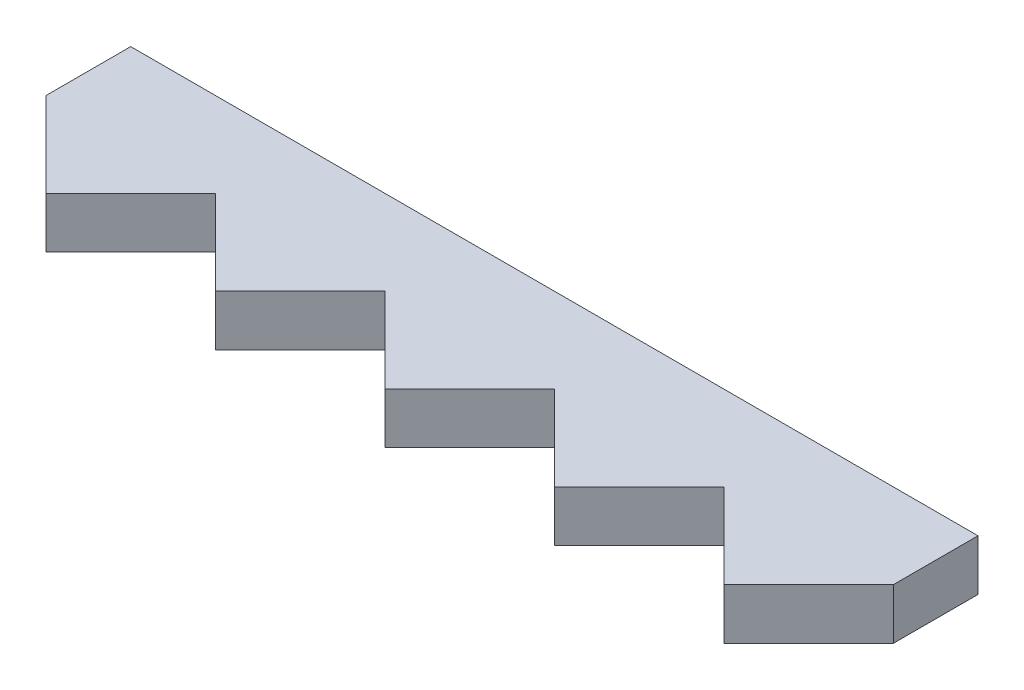
ISO-10303-21;
HEADER;
FILE_DESCRIPTION(('STEP AP214'),'2;1');
FILE_NAME('part.step','',(''),(''),'','','');
FILE_SCHEMA(('AUTOMOTIVE_DESIGN { 1 0 10303 214 1 1 1 1 }'));
ENDSEC;
DATA;
#1=APPLICATION_CONTEXT('core data for automotive mechanical design processes');
#2=APPLICATION_PROTOCOL_DEFINITION('international standard','automotive_design',2000,#1);
#3=PRODUCT_CONTEXT('',#1,'mechanical');
#4=PRODUCT('Part','Part','',(#3));
#5=PRODUCT_RELATED_PRODUCT_CATEGORY('part','',(#4));
#6=PRODUCT_DEFINITION_FORMATION('','',#4);
#7=PRODUCT_DEFINITION_CONTEXT('part definition',#1,'design');
#8=PRODUCT_DEFINITION('design','',#6,#7);
#9=PRODUCT_DEFINITION_SHAPE('','',#8);
#10=(LENGTH_UNIT() NAMED_UNIT(*) SI_UNIT(.MILLI.,.METRE.));
#11=(NAMED_UNIT(*) PLANE_ANGLE_UNIT() SI_UNIT($,.RADIAN.));
#12=(NAMED_UNIT(*) SI_UNIT($,.STERADIAN.) SOLID_ANGLE_UNIT());
#13=UNCERTAINTY_MEASURE_WITH_UNIT(LENGTH_MEASURE(1.E-05),#10,'distance_accuracy_value','');
#14=(GEOMETRIC_REPRESENTATION_CONTEXT(3) GLOBAL_UNCERTAINTY_ASSIGNED_CONTEXT((#13)) GLOBAL_UNIT_ASSIGNED_CONTEXT((#10,
#11,#12)) REPRESENTATION_CONTEXT('',''));
#15=CARTESIAN_POINT('',(0.,0.,0.));
#16=DIRECTION('',(0.,0.,1.));
#17=DIRECTION('',(1.,0.,0.));
#18=AXIS2_PLACEMENT_3D('',#15,#16,#17);
#19=CARTESIAN_POINT('',(0.,6.,-71.6064280380383));
#20=DIRECTION('',(0.,0.,1.));
#21=DIRECTION('',(1.,0.,0.));
#22=AXIS2_PLACEMENT_3D('',#19,#20,#21);
#23=PLANE('',#22);
#24=DIRECTION('',(-1.,0.,0.));
#25=VECTOR('',#24,1.);
#26=CARTESIAN_POINT('',(0.,3.,-71.6064280380383));
#27=LINE('',#26,#25);
#28=CARTESIAN_POINT('',(50.,3.,-71.6064280380383));
#29=VERTEX_POINT('',#28);
#30=CARTESIAN_POINT('',(0.,3.,-71.6064280380383));
#31=VERTEX_POINT('',#30);
#32=EDGE_CURVE('E159',#29,#31,#27,.T.);
#33=ORIENTED_EDGE('',*,*,#32,.T.);
#34=DIRECTION('',(0.,-1.,0.));
#35=VECTOR('',#34,1.);
#36=CARTESIAN_POINT('',(0.,6.,-71.6064280380383));
#37=LINE('',#36,#35);
#38=CARTESIAN_POINT('',(0.,6.,-71.6064280380383));
#39=VERTEX_POINT('',#38);
#40=EDGE_CURVE('E11',#39,#31,#37,.T.);
#41=ORIENTED_EDGE('',*,*,#40,.F.);
#42=DIRECTION('',(-1.,0.,0.));
#43=VECTOR('',#42,1.);
#44=CARTESIAN_POINT('',(0.,6.,-71.6064280380383));
#45=LINE('',#44,#43);
#46=CARTESIAN_POINT('',(50.,6.,-71.6064280380383));
#47=VERTEX_POINT('',#46);
#48=EDGE_CURVE('E183',#47,#39,#45,.T.);
#49=ORIENTED_EDGE('',*,*,#48,.F.);
#50=DIRECTION('',(0.,-1.,0.));
#51=VECTOR('',#50,1.);
#52=CARTESIAN_POINT('',(50.,6.,-71.6064280380383));
#53=LINE('',#52,#51);
#54=EDGE_CURVE('E155',#47,#29,#53,.T.);
#55=ORIENTED_EDGE('',*,*,#54,.T.);
#56=EDGE_LOOP('',(#33,#41,#49,#55));
#57=FACE_BOUND('',#56,.T.);
#58=ADVANCED_FACE('F33',(#57),#23,.F.);
#59=CARTESIAN_POINT('',(0.,6.,-71.6064280380383));
#60=DIRECTION('',(1.,0.,0.));
#61=DIRECTION('',(0.,0.,-1.));
#62=AXIS2_PLACEMENT_3D('',#59,#60,#61);
#63=PLANE('',#62);
#64=DIRECTION('',(0.,0.,1.));
#65=VECTOR('',#64,1.);
#66=CARTESIAN_POINT('',(0.,3.,-71.6064280380383));
#67=LINE('',#66,#65);
#68=CARTESIAN_POINT('',(0.,3.,-66.6064280380382));
#69=VERTEX_POINT('',#68);
#70=EDGE_CURVE('E162',#31,#69,#67,.T.);
#71=ORIENTED_EDGE('',*,*,#70,.T.);
#72=DIRECTION('',(0.,-1.,0.));
#73=VECTOR('',#72,1.);
#74=CARTESIAN_POINT('',(0.,6.,-66.6064280380382));
#75=LINE('',#74,#73);
#76=CARTESIAN_POINT('',(0.,6.,-66.6064280380382));
#77=VERTEX_POINT('',#76);
#78=EDGE_CURVE('E41',#77,#69,#75,.T.);
#79=ORIENTED_EDGE('',*,*,#78,.F.);
#80=DIRECTION('',(0.,0.,1.));
#81=VECTOR('',#80,1.);
#82=CARTESIAN_POINT('',(0.,6.,-71.6064280380383));
#83=LINE('',#82,#81);
#84=EDGE_CURVE('E107',#39,#77,#83,.T.);
#85=ORIENTED_EDGE('',*,*,#84,.F.);
#86=ORIENTED_EDGE('',*,*,#40,.T.);
#87=EDGE_LOOP('',(#71,#79,#85,#86));
#88=FACE_BOUND('',#87,.T.);
#89=ADVANCED_FACE('F266',(#88),#63,.F.);
#90=CARTESIAN_POINT('',(0.,6.,-66.6064280380382));
#91=DIRECTION('',(0.707106781186547,0.,-0.707106781186548));
#92=DIRECTION('',(-0.707106781186548,0.,-0.707106781186547));
#93=AXIS2_PLACEMENT_3D('',#90,#91,#92);
#94=PLANE('',#93);
#95=DIRECTION('',(0.707106781186548,0.,0.707106781186547));
#96=VECTOR('',#95,1.);
#97=CARTESIAN_POINT('',(0.,3.,-66.6064280380382));
#98=LINE('',#97,#96);
#99=CARTESIAN_POINT('',(5.,3.,-61.6064280380383));
#100=VERTEX_POINT('',#99);
#101=EDGE_CURVE('E164',#69,#100,#98,.T.);
#102=ORIENTED_EDGE('',*,*,#101,.T.);
#103=DIRECTION('',(0.,-1.,0.));
#104=VECTOR('',#103,1.);
#105=CARTESIAN_POINT('',(5.,6.,-61.6064280380383));
#106=LINE('',#105,#104);
#107=CARTESIAN_POINT('',(5.,6.,-61.6064280380383));
#108=VERTEX_POINT('',#107);
#109=EDGE_CURVE('E205',#108,#100,#106,.T.);
#110=ORIENTED_EDGE('',*,*,#109,.F.);
#111=DIRECTION('',(0.707106781186548,0.,0.707106781186547));
#112=VECTOR('',#111,1.);
#113=CARTESIAN_POINT('',(0.,6.,-66.6064280380382));
#114=LINE('',#113,#112);
#115=EDGE_CURVE('E213',#77,#108,#114,.T.);
#116=ORIENTED_EDGE('',*,*,#115,.F.);
#117=ORIENTED_EDGE('',*,*,#78,.T.);
#118=EDGE_LOOP('',(#102,#110,#116,#117));
#119=FACE_BOUND('',#118,.T.);
#120=ADVANCED_FACE('F211',(#119),#94,.F.);
#121=CARTESIAN_POINT('',(5.,6.,-61.6064280380383));
#122=DIRECTION('',(-0.707106781186547,0.,-0.707106781186548));
#123=DIRECTION('',(-0.707106781186548,0.,0.707106781186547));
#124=AXIS2_PLACEMENT_3D('',#121,#122,#123);
#125=PLANE('',#124);
#126=DIRECTION('',(0.707106781186548,0.,-0.707106781186547));
#127=VECTOR('',#126,1.);
#128=CARTESIAN_POINT('',(5.,3.,-61.6064280380383));
#129=LINE('',#128,#127);
#130=CARTESIAN_POINT('',(10.,3.,-66.6064280380382));
#131=VERTEX_POINT('',#130);
#132=EDGE_CURVE('E166',#100,#131,#129,.T.);
#133=ORIENTED_EDGE('',*,*,#132,.T.);
#134=DIRECTION('',(0.,-1.,0.));
#135=VECTOR('',#134,1.);
#136=CARTESIAN_POINT('',(10.,6.,-66.6064280380382));
#137=LINE('',#136,#135);
#138=CARTESIAN_POINT('',(10.,6.,-66.6064280380382));
#139=VERTEX_POINT('',#138);
#140=EDGE_CURVE('E202',#139,#131,#137,.T.);
#141=ORIENTED_EDGE('',*,*,#140,.F.);
#142=DIRECTION('',(0.707106781186548,0.,-0.707106781186547));
#143=VECTOR('',#142,1.);
#144=CARTESIAN_POINT('',(5.,6.,-61.6064280380383));
#145=LINE('',#144,#143);
#146=EDGE_CURVE('E231',#108,#139,#145,.T.);
#147=ORIENTED_EDGE('',*,*,#146,.F.);
#148=ORIENTED_EDGE('',*,*,#109,.T.);
#149=EDGE_LOOP('',(#133,#141,#147,#148));
#150=FACE_BOUND('',#149,.T.);
#151=ADVANCED_FACE('F222',(#150),#125,.F.);
#152=CARTESIAN_POINT('',(10.,6.,-66.6064280380382));
#153=DIRECTION('',(0.707106781186548,0.,-0.707106781186548));
#154=DIRECTION('',(-0.707106781186548,0.,-0.707106781186548));
#155=AXIS2_PLACEMENT_3D('',#152,#153,#154);
#156=PLANE('',#155);
#157=DIRECTION('',(0.707106781186547,0.,0.707106781186547));
#158=VECTOR('',#157,1.);
#159=CARTESIAN_POINT('',(10.,3.,-66.6064280380382));
#160=LINE('',#159,#158);
#161=CARTESIAN_POINT('',(15.,3.,-61.6064280380383));
#162=VERTEX_POINT('',#161);
#163=EDGE_CURVE('E168',#131,#162,#160,.T.);
#164=ORIENTED_EDGE('',*,*,#163,.T.);
#165=DIRECTION('',(0.,-1.,0.));
#166=VECTOR('',#165,1.);
#167=CARTESIAN_POINT('',(15.,6.,-61.6064280380383));
#168=LINE('',#167,#166);
#169=CARTESIAN_POINT('',(15.,6.,-61.6064280380383));
#170=VERTEX_POINT('',#169);
#171=EDGE_CURVE('E199',#170,#162,#168,.T.);
#172=ORIENTED_EDGE('',*,*,#171,.F.);
#173=DIRECTION('',(0.707106781186547,0.,0.707106781186547));
#174=VECTOR('',#173,1.);
#175=CARTESIAN_POINT('',(10.,6.,-66.6064280380382));
#176=LINE('',#175,#174);
#177=EDGE_CURVE('E228',#139,#170,#176,.T.);
#178=ORIENTED_EDGE('',*,*,#177,.F.);
#179=ORIENTED_EDGE('',*,*,#140,.T.);
#180=EDGE_LOOP('',(#164,#172,#178,#179));
#181=FACE_BOUND('',#180,.T.);
#182=ADVANCED_FACE('F226',(#181),#156,.F.);
#183=CARTESIAN_POINT('',(15.,6.,-61.6064280380383));
#184=DIRECTION('',(-0.707106781186547,0.,-0.707106781186548));
#185=DIRECTION('',(-0.707106781186548,0.,0.707106781186547));
#186=AXIS2_PLACEMENT_3D('',#183,#184,#185);
#187=PLANE('',#186);
#188=DIRECTION('',(0.707106781186548,0.,-0.707106781186547));
#189=VECTOR('',#188,1.);
#190=CARTESIAN_POINT('',(15.,3.,-61.6064280380383));
#191=LINE('',#190,#189);
#192=CARTESIAN_POINT('',(20.,3.,-66.6064280380382));
#193=VERTEX_POINT('',#192);
#194=EDGE_CURVE('E170',#162,#193,#191,.T.);
#195=ORIENTED_EDGE('',*,*,#194,.T.);
#196=DIRECTION('',(0.,-1.,0.));
#197=VECTOR('',#196,1.);
#198=CARTESIAN_POINT('',(20.,6.,-66.6064280380382));
#199=LINE('',#198,#197);
#200=CARTESIAN_POINT('',(20.,6.,-66.6064280380382));
#201=VERTEX_POINT('',#200);
#202=EDGE_CURVE('E196',#201,#193,#199,.T.);
#203=ORIENTED_EDGE('',*,*,#202,.F.);
#204=DIRECTION('',(0.707106781186548,0.,-0.707106781186547));
#205=VECTOR('',#204,1.);
#206=CARTESIAN_POINT('',(15.,6.,-61.6064280380383));
#207=LINE('',#206,#205);
#208=EDGE_CURVE('E230',#170,#201,#207,.T.);
#209=ORIENTED_EDGE('',*,*,#208,.F.);
#210=ORIENTED_EDGE('',*,*,#171,.T.);
#211=EDGE_LOOP('',(#195,#203,#209,#210));
#212=FACE_BOUND('',#211,.T.);
#213=ADVANCED_FACE('F279',(#212),#187,.F.);
#214=CARTESIAN_POINT('',(20.,6.,-66.6064280380382));
#215=DIRECTION('',(0.707106781186547,0.,-0.707106781186548));
#216=DIRECTION('',(-0.707106781186548,0.,-0.707106781186547));
#217=AXIS2_PLACEMENT_3D('',#214,#215,#216);
#218=PLANE('',#217);
#219=DIRECTION('',(0.707106781186548,0.,0.707106781186547));
#220=VECTOR('',#219,1.);
#221=CARTESIAN_POINT('',(20.,3.,-66.6064280380382));
#222=LINE('',#221,#220);
#223=CARTESIAN_POINT('',(25.,3.,-61.6064280380383));
#224=VERTEX_POINT('',#223);
#225=EDGE_CURVE('E172',#193,#224,#222,.T.);
#226=ORIENTED_EDGE('',*,*,#225,.T.);
#227=DIRECTION('',(0.,-1.,0.));
#228=VECTOR('',#227,1.);
#229=CARTESIAN_POINT('',(25.,6.,-61.6064280380383));
#230=LINE('',#229,#228);
#231=CARTESIAN_POINT('',(25.,6.,-61.6064280380383));
#232=VERTEX_POINT('',#231);
#233=EDGE_CURVE('E193',#232,#224,#230,.T.);
#234=ORIENTED_EDGE('',*,*,#233,.F.);
#235=DIRECTION('',(0.707106781186548,0.,0.707106781186547));
#236=VECTOR('',#235,1.);
#237=CARTESIAN_POINT('',(20.,6.,-66.6064280380382));
#238=LINE('',#237,#236);
#239=EDGE_CURVE('E233',#201,#232,#238,.T.);
#240=ORIENTED_EDGE('',*,*,#239,.F.);
#241=ORIENTED_EDGE('',*,*,#202,.T.);
#242=EDGE_LOOP('',(#226,#234,#240,#241));
#243=FACE_BOUND('',#242,.T.);
#244=ADVANCED_FACE('F282',(#243),#218,.F.);
#245=CARTESIAN_POINT('',(25.,6.,-61.6064280380383));
#246=DIRECTION('',(-0.707106781186547,0.,-0.707106781186548));
#247=DIRECTION('',(-0.707106781186548,0.,0.707106781186547));
#248=AXIS2_PLACEMENT_3D('',#245,#246,#247);
#249=PLANE('',#248);
#250=DIRECTION('',(0.707106781186548,0.,-0.707106781186547));
#251=VECTOR('',#250,1.);
#252=CARTESIAN_POINT('',(25.,3.,-61.6064280380383));
#253=LINE('',#252,#251);
#254=CARTESIAN_POINT('',(30.,3.,-66.6064280380382));
#255=VERTEX_POINT('',#254);
#256=EDGE_CURVE('E174',#224,#255,#253,.T.);
#257=ORIENTED_EDGE('',*,*,#256,.T.);
#258=DIRECTION('',(0.,-1.,0.));
#259=VECTOR('',#258,1.);
#260=CARTESIAN_POINT('',(30.,6.,-66.6064280380382));
#261=LINE('',#260,#259);
#262=CARTESIAN_POINT('',(30.,6.,-66.6064280380382));
#263=VERTEX_POINT('',#262);
#264=EDGE_CURVE('E190',#263,#255,#261,.T.);
#265=ORIENTED_EDGE('',*,*,#264,.F.);
#266=DIRECTION('',(0.707106781186548,0.,-0.707106781186547));
#267=VECTOR('',#266,1.);
#268=CARTESIAN_POINT('',(25.,6.,-61.6064280380383));
#269=LINE('',#268,#267);
#270=EDGE_CURVE('E239',#232,#263,#269,.T.);
#271=ORIENTED_EDGE('',*,*,#270,.F.);
#272=ORIENTED_EDGE('',*,*,#233,.T.);
#273=EDGE_LOOP('',(#257,#265,#271,#272));
#274=FACE_BOUND('',#273,.T.);
#275=ADVANCED_FACE('F286',(#274),#249,.F.);
#276=CARTESIAN_POINT('',(30.,6.,-66.6064280380382));
#277=DIRECTION('',(0.707106781186547,0.,-0.707106781186548));
#278=DIRECTION('',(-0.707106781186548,0.,-0.707106781186547));
#279=AXIS2_PLACEMENT_3D('',#276,#277,#278);
#280=PLANE('',#279);
#281=DIRECTION('',(0.707106781186548,0.,0.707106781186547));
#282=VECTOR('',#281,1.);
#283=CARTESIAN_POINT('',(30.,3.,-66.6064280380382));
#284=LINE('',#283,#282);
#285=CARTESIAN_POINT('',(35.,3.,-61.6064280380383));
#286=VERTEX_POINT('',#285);
#287=EDGE_CURVE('E176',#255,#286,#284,.T.);
#288=ORIENTED_EDGE('',*,*,#287,.T.);
#289=DIRECTION('',(0.,-1.,0.));
#290=VECTOR('',#289,1.);
#291=CARTESIAN_POINT('',(35.,6.,-61.6064280380383));
#292=LINE('',#291,#290);
#293=CARTESIAN_POINT('',(35.,6.,-61.6064280380383));
#294=VERTEX_POINT('',#293);
#295=EDGE_CURVE('E187',#294,#286,#292,.T.);
#296=ORIENTED_EDGE('',*,*,#295,.F.);
#297=DIRECTION('',(0.707106781186548,0.,0.707106781186547));
#298=VECTOR('',#297,1.);
#299=CARTESIAN_POINT('',(30.,6.,-66.6064280380382));
#300=LINE('',#299,#298);
#301=EDGE_CURVE('E241',#263,#294,#300,.T.);
#302=ORIENTED_EDGE('',*,*,#301,.F.);
#303=ORIENTED_EDGE('',*,*,#264,.T.);
#304=EDGE_LOOP('',(#288,#296,#302,#303));
#305=FACE_BOUND('',#304,.T.);
#306=ADVANCED_FACE('F247',(#305),#280,.F.);
#307=CARTESIAN_POINT('',(35.,6.,-61.6064280380383));
#308=DIRECTION('',(-0.707106781186548,0.,-0.707106781186548));
#309=DIRECTION('',(-0.707106781186548,0.,0.707106781186548));
#310=AXIS2_PLACEMENT_3D('',#307,#308,#309);
#311=PLANE('',#310);
#312=DIRECTION('',(0.707106781186547,0.,-0.707106781186547));
#313=VECTOR('',#312,1.);
#314=CARTESIAN_POINT('',(35.,3.,-61.6064280380383));
#315=LINE('',#314,#313);
#316=CARTESIAN_POINT('',(40.,3.,-66.6064280380382));
#317=VERTEX_POINT('',#316);
#318=EDGE_CURVE('E178',#286,#317,#315,.T.);
#319=ORIENTED_EDGE('',*,*,#318,.T.);
#320=DIRECTION('',(0.,-1.,0.));
#321=VECTOR('',#320,1.);
#322=CARTESIAN_POINT('',(40.,6.,-66.6064280380382));
#323=LINE('',#322,#321);
#324=CARTESIAN_POINT('',(40.,6.,-66.6064280380382));
#325=VERTEX_POINT('',#324);
#326=EDGE_CURVE('E150',#325,#317,#323,.T.);
#327=ORIENTED_EDGE('',*,*,#326,.F.);
#328=DIRECTION('',(0.707106781186547,0.,-0.707106781186547));
#329=VECTOR('',#328,1.);
#330=CARTESIAN_POINT('',(35.,6.,-61.6064280380383));
#331=LINE('',#330,#329);
#332=EDGE_CURVE('E141',#294,#325,#331,.T.);
#333=ORIENTED_EDGE('',*,*,#332,.F.);
#334=ORIENTED_EDGE('',*,*,#295,.T.);
#335=EDGE_LOOP('',(#319,#327,#333,#334));
#336=FACE_BOUND('',#335,.T.);
#337=ADVANCED_FACE('F251',(#336),#311,.F.);
#338=CARTESIAN_POINT('',(40.,6.,-66.6064280380382));
#339=DIRECTION('',(0.707106781186547,0.,-0.707106781186548));
#340=DIRECTION('',(-0.707106781186548,0.,-0.707106781186547));
#341=AXIS2_PLACEMENT_3D('',#338,#339,#340);
#342=PLANE('',#341);
#343=DIRECTION('',(0.707106781186548,0.,0.707106781186547));
#344=VECTOR('',#343,1.);
#345=CARTESIAN_POINT('',(40.,3.,-66.6064280380382));
#346=LINE('',#345,#344);
#347=CARTESIAN_POINT('',(45.,3.,-61.6064280380383));
#348=VERTEX_POINT('',#347);
#349=EDGE_CURVE('E149',#317,#348,#346,.T.);
#350=ORIENTED_EDGE('',*,*,#349,.T.);
#351=DIRECTION('',(0.,-1.,0.));
#352=VECTOR('',#351,1.);
#353=CARTESIAN_POINT('',(45.,6.,-61.6064280380383));
#354=LINE('',#353,#352);
#355=CARTESIAN_POINT('',(45.,6.,-61.6064280380383));
#356=VERTEX_POINT('',#355);
#357=EDGE_CURVE('E146',#356,#348,#354,.T.);
#358=ORIENTED_EDGE('',*,*,#357,.F.);
#359=DIRECTION('',(0.707106781186548,0.,0.707106781186547));
#360=VECTOR('',#359,1.);
#361=CARTESIAN_POINT('',(40.,6.,-66.6064280380382));
#362=LINE('',#361,#360);
#363=EDGE_CURVE('E135',#325,#356,#362,.T.);
#364=ORIENTED_EDGE('',*,*,#363,.F.);
#365=ORIENTED_EDGE('',*,*,#326,.T.);
#366=EDGE_LOOP('',(#350,#358,#364,#365));
#367=FACE_BOUND('',#366,.T.);
#368=ADVANCED_FACE('F147',(#367),#342,.F.);
#369=CARTESIAN_POINT('',(45.,6.,-61.6064280380383));
#370=DIRECTION('',(-0.707106781186547,0.,-0.707106781186549));
#371=DIRECTION('',(-0.707106781186549,0.,0.707106781186547));
#372=AXIS2_PLACEMENT_3D('',#369,#370,#371);
#373=PLANE('',#372);
#374=DIRECTION('',(0.707106781186548,0.,-0.707106781186546));
#375=VECTOR('',#374,1.);
#376=CARTESIAN_POINT('',(45.,3.,-61.6064280380383));
#377=LINE('',#376,#375);
#378=CARTESIAN_POINT('',(50.,3.,-66.6064280380382));
#379=VERTEX_POINT('',#378);
#380=EDGE_CURVE('E93',#348,#379,#377,.T.);
#381=ORIENTED_EDGE('',*,*,#380,.T.);
#382=DIRECTION('',(0.,-1.,0.));
#383=VECTOR('',#382,1.);
#384=CARTESIAN_POINT('',(50.,6.,-66.6064280380382));
#385=LINE('',#384,#383);
#386=CARTESIAN_POINT('',(50.,6.,-66.6064280380382));
#387=VERTEX_POINT('',#386);
#388=EDGE_CURVE('E151',#387,#379,#385,.T.);
#389=ORIENTED_EDGE('',*,*,#388,.F.);
#390=DIRECTION('',(0.707106781186548,0.,-0.707106781186546));
#391=VECTOR('',#390,1.);
#392=CARTESIAN_POINT('',(45.,6.,-61.6064280380383));
#393=LINE('',#392,#391);
#394=EDGE_CURVE('E139',#356,#387,#393,.T.);
#395=ORIENTED_EDGE('',*,*,#394,.F.);
#396=ORIENTED_EDGE('',*,*,#357,.T.);
#397=EDGE_LOOP('',(#381,#389,#395,#396));
#398=FACE_BOUND('',#397,.T.);
#399=ADVANCED_FACE('F153',(#398),#373,.F.);
#400=CARTESIAN_POINT('',(50.,6.,-71.6064280380383));
#401=DIRECTION('',(-1.,0.,0.));
#402=DIRECTION('',(0.,0.,1.));
#403=AXIS2_PLACEMENT_3D('',#400,#401,#402);
#404=PLANE('',#403);
#405=DIRECTION('',(0.,0.,-1.));
#406=VECTOR('',#405,1.);
#407=CARTESIAN_POINT('',(50.,3.,-71.6064280380383));
#408=LINE('',#407,#406);
#409=EDGE_CURVE('E99',#379,#29,#408,.T.);
#410=ORIENTED_EDGE('',*,*,#409,.T.);
#411=ORIENTED_EDGE('',*,*,#54,.F.);
#412=DIRECTION('',(0.,0.,-1.));
#413=VECTOR('',#412,1.);
#414=CARTESIAN_POINT('',(50.,6.,-71.6064280380383));
#415=LINE('',#414,#413);
#416=EDGE_CURVE('E49',#387,#47,#415,.T.);
#417=ORIENTED_EDGE('',*,*,#416,.F.);
#418=ORIENTED_EDGE('',*,*,#388,.T.);
#419=EDGE_LOOP('',(#410,#411,#417,#418));
#420=FACE_BOUND('',#419,.T.);
#421=ADVANCED_FACE('F255',(#420),#404,.F.);
#422=CARTESIAN_POINT('',(0.,6.,0.));
#423=DIRECTION('',(0.,-1.,0.));
#424=DIRECTION('',(0.,0.,-1.));
#425=AXIS2_PLACEMENT_3D('',#422,#423,#424);
#426=PLANE('',#425);
#427=ORIENTED_EDGE('',*,*,#48,.T.);
#428=ORIENTED_EDGE('',*,*,#84,.T.);
#429=ORIENTED_EDGE('',*,*,#115,.T.);
#430=ORIENTED_EDGE('',*,*,#146,.T.);
#431=ORIENTED_EDGE('',*,*,#177,.T.);
#432=ORIENTED_EDGE('',*,*,#208,.T.);
#433=ORIENTED_EDGE('',*,*,#239,.T.);
#434=ORIENTED_EDGE('',*,*,#270,.T.);
#435=ORIENTED_EDGE('',*,*,#301,.T.);
#436=ORIENTED_EDGE('',*,*,#332,.T.);
#437=ORIENTED_EDGE('',*,*,#363,.T.);
#438=ORIENTED_EDGE('',*,*,#394,.T.);
#439=ORIENTED_EDGE('',*,*,#416,.T.);
#440=EDGE_LOOP('',(#427,#428,#429,#430,#431,#432,#433,#434,#435,#436,#437,#438,#439));
#441=FACE_BOUND('',#440,.T.);
#442=ADVANCED_FACE('F137',(#441),#426,.F.);
#443=CARTESIAN_POINT('',(0.,3.,0.));
#444=DIRECTION('',(0.,-1.,0.));
#445=DIRECTION('',(0.,0.,-1.));
#446=AXIS2_PLACEMENT_3D('',#443,#444,#445);
#447=PLANE('',#446);
#448=ORIENTED_EDGE('',*,*,#32,.F.);
#449=ORIENTED_EDGE('',*,*,#409,.F.);
#450=ORIENTED_EDGE('',*,*,#380,.F.);
#451=ORIENTED_EDGE('',*,*,#349,.F.);
#452=ORIENTED_EDGE('',*,*,#318,.F.);
#453=ORIENTED_EDGE('',*,*,#287,.F.);
#454=ORIENTED_EDGE('',*,*,#256,.F.);
#455=ORIENTED_EDGE('',*,*,#225,.F.);
#456=ORIENTED_EDGE('',*,*,#194,.F.);
#457=ORIENTED_EDGE('',*,*,#163,.F.);
#458=ORIENTED_EDGE('',*,*,#132,.F.);
#459=ORIENTED_EDGE('',*,*,#101,.F.);
#460=ORIENTED_EDGE('',*,*,#70,.F.);
#461=EDGE_LOOP('',(#448,#449,#450,#451,#452,#453,#454,#455,#456,#457,#458,#459,#460));
#462=FACE_BOUND('',#461,.T.);
#463=ADVANCED_FACE('F217',(#462),#447,.T.);
#464=CLOSED_SHELL('',(#58,#89,#120,#151,#182,#213,#244,#275,#306,#337,#368,#399,#421,#442,#463));
#465=MANIFOLD_SOLID_BREP('B2',#464);
#466=ADVANCED_BREP_SHAPE_REPRESENTATION('',(#18,#465),#14);
#467=SHAPE_DEFINITION_REPRESENTATION(#9,#466);
ENDSEC;
END-ISO-10303-21;
